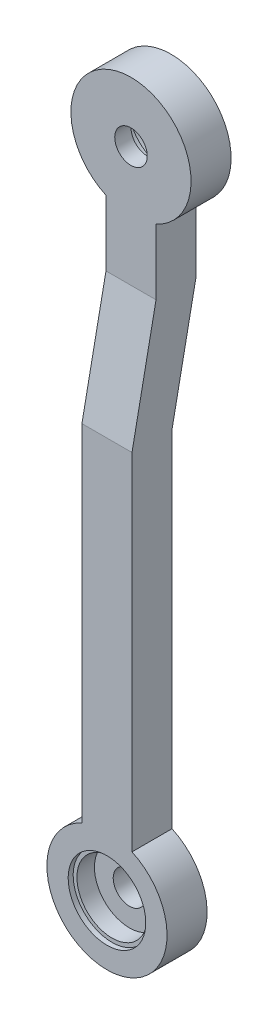
ISO-10303-21;
HEADER;
FILE_DESCRIPTION(('STEP AP214'),'2;1');
FILE_NAME('part.step','',(''),(''),'','','');
FILE_SCHEMA(('AUTOMOTIVE_DESIGN { 1 0 10303 214 1 1 1 1 }'));
ENDSEC;
DATA;
#1=APPLICATION_CONTEXT('core data for automotive mechanical design processes');
#2=APPLICATION_PROTOCOL_DEFINITION('international standard','automotive_design',2000,#1);
#3=PRODUCT_CONTEXT('',#1,'mechanical');
#4=PRODUCT('Part','Part','',(#3));
#5=PRODUCT_RELATED_PRODUCT_CATEGORY('part','',(#4));
#6=PRODUCT_DEFINITION_FORMATION('','',#4);
#7=PRODUCT_DEFINITION_CONTEXT('part definition',#1,'design');
#8=PRODUCT_DEFINITION('design','',#6,#7);
#9=PRODUCT_DEFINITION_SHAPE('','',#8);
#10=(LENGTH_UNIT() NAMED_UNIT(*) SI_UNIT(.MILLI.,.METRE.));
#11=(NAMED_UNIT(*) PLANE_ANGLE_UNIT() SI_UNIT($,.RADIAN.));
#12=(NAMED_UNIT(*) SI_UNIT($,.STERADIAN.) SOLID_ANGLE_UNIT());
#13=UNCERTAINTY_MEASURE_WITH_UNIT(LENGTH_MEASURE(1.E-05),#10,'distance_accuracy_value','');
#14=(GEOMETRIC_REPRESENTATION_CONTEXT(3) GLOBAL_UNCERTAINTY_ASSIGNED_CONTEXT((#13)) GLOBAL_UNIT_ASSIGNED_CONTEXT((#10,
#11,#12)) REPRESENTATION_CONTEXT('',''));
#15=CARTESIAN_POINT('',(0.,0.,0.));
#16=DIRECTION('',(0.,0.,1.));
#17=DIRECTION('',(1.,0.,0.));
#18=AXIS2_PLACEMENT_3D('',#15,#16,#17);
#19=CARTESIAN_POINT('',(0.,0.,6.35));
#20=DIRECTION('',(0.,0.,1.));
#21=DIRECTION('',(1.,0.,0.));
#22=AXIS2_PLACEMENT_3D('',#19,#20,#21);
#23=CYLINDRICAL_SURFACE('',#22,5.15873999999999);
#24=CARTESIAN_POINT('',(0.,0.,-6.35));
#25=DIRECTION('',(0.,0.,-1.));
#26=DIRECTION('',(0.,1.,0.));
#27=AXIS2_PLACEMENT_3D('',#24,#25,#26);
#28=CIRCLE('',#27,5.15873999999999);
#29=CARTESIAN_POINT('',(0.,5.15873999999999,-6.35));
#30=VERTEX_POINT('',#29);
#31=EDGE_CURVE('E128',#30,#30,#28,.T.);
#32=ORIENTED_EDGE('',*,*,#31,.T.);
#33=EDGE_LOOP('',(#32));
#34=FACE_BOUND('',#33,.T.);
#35=CARTESIAN_POINT('',(0.,0.,-0.79375000000001));
#36=DIRECTION('',(0.,0.,1.));
#37=DIRECTION('',(1.,0.,0.));
#38=AXIS2_PLACEMENT_3D('',#35,#36,#37);
#39=CIRCLE('',#38,5.15873999999999);
#40=CARTESIAN_POINT('',(5.15873999999999,0.,-0.79375000000001));
#41=VERTEX_POINT('',#40);
#42=EDGE_CURVE('E48',#41,#41,#39,.F.);
#43=ORIENTED_EDGE('',*,*,#42,.F.);
#44=EDGE_LOOP('',(#43));
#45=FACE_BOUND('',#44,.T.);
#46=ADVANCED_FACE('F44',(#34,#45),#23,.F.);
#47=CARTESIAN_POINT('',(0.,203.2,6.35));
#48=DIRECTION('',(0.,0.,1.));
#49=DIRECTION('',(1.,0.,0.));
#50=AXIS2_PLACEMENT_3D('',#47,#48,#49);
#51=CYLINDRICAL_SURFACE('',#50,5.15873999999999);
#52=CARTESIAN_POINT('',(0.,203.2,-1.26999999999997));
#53=DIRECTION('',(0.,0.,1.));
#54=DIRECTION('',(0.,-1.,0.));
#55=AXIS2_PLACEMENT_3D('',#52,#53,#54);
#56=CIRCLE('',#55,5.15873999999999);
#57=CARTESIAN_POINT('',(0.,198.04126,-1.26999999999997));
#58=VERTEX_POINT('',#57);
#59=EDGE_CURVE('E177',#58,#58,#56,.T.);
#60=ORIENTED_EDGE('',*,*,#59,.T.);
#61=EDGE_LOOP('',(#60));
#62=FACE_BOUND('',#61,.T.);
#63=CARTESIAN_POINT('',(0.,203.2,-6.44524999999996));
#64=DIRECTION('',(0.,0.,-1.));
#65=DIRECTION('',(-1.,0.,0.));
#66=AXIS2_PLACEMENT_3D('',#63,#64,#65);
#67=CIRCLE('',#66,5.15873999999999);
#68=CARTESIAN_POINT('',(-5.15873999999999,203.2,-6.44524999999996));
#69=VERTEX_POINT('',#68);
#70=EDGE_CURVE('E179',#69,#69,#67,.F.);
#71=ORIENTED_EDGE('',*,*,#70,.F.);
#72=EDGE_LOOP('',(#71));
#73=FACE_BOUND('',#72,.T.);
#74=ADVANCED_FACE('F241',(#62,#73),#51,.F.);
#75=CARTESIAN_POINT('',(0.,0.,6.35));
#76=DIRECTION('',(0.,0.,1.));
#77=DIRECTION('',(1.,0.,0.));
#78=AXIS2_PLACEMENT_3D('',#75,#76,#77);
#79=PLANE('',#78);
#80=CARTESIAN_POINT('',(0.,0.,6.34999999999999));
#81=DIRECTION('',(0.,0.,1.));
#82=DIRECTION('',(0.,-1.,0.));
#83=AXIS2_PLACEMENT_3D('',#80,#81,#82);
#84=CIRCLE('',#83,12.303125);
#85=CARTESIAN_POINT('',(0.,-12.303125,6.34999999999999));
#86=VERTEX_POINT('',#85);
#87=EDGE_CURVE('E199',#86,#86,#84,.T.);
#88=ORIENTED_EDGE('',*,*,#87,.F.);
#89=EDGE_LOOP('',(#88));
#90=FACE_BOUND('',#89,.T.);
#91=DIRECTION('',(0.,1.,0.));
#92=VECTOR('',#91,1.);
#93=CARTESIAN_POINT('',(7.9375,185.882419518016,6.35));
#94=LINE('',#93,#92);
#95=CARTESIAN_POINT('',(7.93749999999998,17.3175804819842,6.35));
#96=VERTEX_POINT('',#95);
#97=CARTESIAN_POINT('',(7.93749999999999,127.,6.35));
#98=VERTEX_POINT('',#97);
#99=EDGE_CURVE('E151',#96,#98,#94,.T.);
#100=ORIENTED_EDGE('',*,*,#99,.T.);
#101=DIRECTION('',(1.,0.,0.));
#102=VECTOR('',#101,1.);
#103=CARTESIAN_POINT('',(-19.05,127.,6.35));
#104=LINE('',#103,#102);
#105=CARTESIAN_POINT('',(-7.9375,127.,6.35));
#106=VERTEX_POINT('',#105);
#107=EDGE_CURVE('E208',#106,#98,#104,.T.);
#108=ORIENTED_EDGE('',*,*,#107,.F.);
#109=DIRECTION('',(0.,-1.,0.));
#110=VECTOR('',#109,1.);
#111=CARTESIAN_POINT('',(-7.9375,185.882419518016,6.35));
#112=LINE('',#111,#110);
#113=CARTESIAN_POINT('',(-7.93749999999998,17.3175804819842,6.35));
#114=VERTEX_POINT('',#113);
#115=EDGE_CURVE('E149',#106,#114,#112,.T.);
#116=ORIENTED_EDGE('',*,*,#115,.T.);
#117=CARTESIAN_POINT('',(0.,0.,6.35));
#118=DIRECTION('',(0.,0.,1.));
#119=DIRECTION('',(1.,0.,0.));
#120=AXIS2_PLACEMENT_3D('',#117,#118,#119);
#121=CIRCLE('',#120,19.05);
#122=EDGE_CURVE('E158',#114,#96,#121,.T.);
#123=ORIENTED_EDGE('',*,*,#122,.T.);
#124=EDGE_LOOP('',(#100,#108,#116,#123));
#125=FACE_BOUND('',#124,.T.);
#126=ADVANCED_FACE('F221',(#90,#125),#79,.T.);
#127=CARTESIAN_POINT('',(0.,0.,6.35));
#128=DIRECTION('',(0.,0.,-1.));
#129=DIRECTION('',(-1.,0.,0.));
#130=AXIS2_PLACEMENT_3D('',#127,#128,#129);
#131=CYLINDRICAL_SURFACE('',#130,19.05);
#132=DIRECTION('',(0.,0.,1.));
#133=VECTOR('',#132,1.);
#134=CARTESIAN_POINT('',(7.93749999999998,17.3175804819842,-6.35));
#135=LINE('',#134,#133);
#136=CARTESIAN_POINT('',(7.93749999999998,17.3175804819842,-6.35000000000002));
#137=VERTEX_POINT('',#136);
#138=EDGE_CURVE('E159',#137,#96,#135,.T.);
#139=ORIENTED_EDGE('',*,*,#138,.T.);
#140=ORIENTED_EDGE('',*,*,#122,.F.);
#141=DIRECTION('',(0.,0.,1.));
#142=VECTOR('',#141,1.);
#143=CARTESIAN_POINT('',(-7.93749999999998,17.3175804819842,-6.35));
#144=LINE('',#143,#142);
#145=CARTESIAN_POINT('',(-7.93749999999997,17.3175804819842,-6.35));
#146=VERTEX_POINT('',#145);
#147=EDGE_CURVE('E162',#146,#114,#144,.T.);
#148=ORIENTED_EDGE('',*,*,#147,.F.);
#149=CARTESIAN_POINT('',(0.,0.,-6.35));
#150=DIRECTION('',(0.,0.,-1.));
#151=DIRECTION('',(0.,1.,0.));
#152=AXIS2_PLACEMENT_3D('',#149,#150,#151);
#153=CIRCLE('',#152,19.05);
#154=EDGE_CURVE('E113',#137,#146,#153,.T.);
#155=ORIENTED_EDGE('',*,*,#154,.F.);
#156=EDGE_LOOP('',(#139,#140,#148,#155));
#157=FACE_BOUND('',#156,.T.);
#158=ADVANCED_FACE('F46',(#157),#131,.T.);
#159=CARTESIAN_POINT('',(0.,203.2,6.35));
#160=DIRECTION('',(0.,0.,-1.));
#161=DIRECTION('',(-1.,0.,0.));
#162=AXIS2_PLACEMENT_3D('',#159,#160,#161);
#163=CYLINDRICAL_SURFACE('',#162,19.05);
#164=CARTESIAN_POINT('',(0.,203.2,-1.26999999999997));
#165=DIRECTION('',(0.,0.,1.));
#166=DIRECTION('',(0.,-1.,0.));
#167=AXIS2_PLACEMENT_3D('',#164,#165,#166);
#168=CIRCLE('',#167,19.05);
#169=CARTESIAN_POINT('',(7.9375,185.882419518016,-1.26999999999997));
#170=VERTEX_POINT('',#169);
#171=CARTESIAN_POINT('',(-7.93749999999999,185.882419518016,-1.26999999999997));
#172=VERTEX_POINT('',#171);
#173=EDGE_CURVE('E141',#170,#172,#168,.T.);
#174=ORIENTED_EDGE('',*,*,#173,.F.);
#175=DIRECTION('',(0.,0.,1.));
#176=VECTOR('',#175,1.);
#177=CARTESIAN_POINT('',(7.9375,185.882419518016,-6.35));
#178=LINE('',#177,#176);
#179=CARTESIAN_POINT('',(7.9375,185.882419518016,-13.9699999999999));
#180=VERTEX_POINT('',#179);
#181=EDGE_CURVE('E155',#180,#170,#178,.T.);
#182=ORIENTED_EDGE('',*,*,#181,.F.);
#183=CARTESIAN_POINT('',(0.,203.2,-13.9699999999999));
#184=DIRECTION('',(0.,0.,-1.));
#185=DIRECTION('',(0.,1.,0.));
#186=AXIS2_PLACEMENT_3D('',#183,#184,#185);
#187=CIRCLE('',#186,19.05);
#188=CARTESIAN_POINT('',(-7.93749999999999,185.882419518016,-13.9699999999999));
#189=VERTEX_POINT('',#188);
#190=EDGE_CURVE('E135',#189,#180,#187,.T.);
#191=ORIENTED_EDGE('',*,*,#190,.F.);
#192=DIRECTION('',(0.,0.,1.));
#193=VECTOR('',#192,1.);
#194=CARTESIAN_POINT('',(-7.9375,185.882419518016,-6.35));
#195=LINE('',#194,#193);
#196=EDGE_CURVE('E154',#189,#172,#195,.T.);
#197=ORIENTED_EDGE('',*,*,#196,.T.);
#198=EDGE_LOOP('',(#174,#182,#191,#197));
#199=FACE_BOUND('',#198,.T.);
#200=ADVANCED_FACE('F227',(#199),#163,.T.);
#201=CARTESIAN_POINT('',(-7.9375,185.882419518016,-6.35));
#202=DIRECTION('',(-1.,0.,0.));
#203=DIRECTION('',(0.,-1.,0.));
#204=AXIS2_PLACEMENT_3D('',#201,#202,#203);
#205=PLANE('',#204);
#206=ORIENTED_EDGE('',*,*,#115,.F.);
#207=DIRECTION('',(0.,0.98058067569092,-0.196116135138184));
#208=VECTOR('',#207,1.);
#209=CARTESIAN_POINT('',(-7.9375,186.060018767323,-5.46200375346454));
#210=LINE('',#209,#208);
#211=CARTESIAN_POINT('',(-7.9375,165.1,-1.26999999999998));
#212=VERTEX_POINT('',#211);
#213=EDGE_CURVE('E146',#106,#212,#210,.T.);
#214=ORIENTED_EDGE('',*,*,#213,.T.);
#215=DIRECTION('',(0.,1.,0.));
#216=VECTOR('',#215,1.);
#217=CARTESIAN_POINT('',(-7.9375,185.882419518016,-1.26999999999997));
#218=LINE('',#217,#216);
#219=EDGE_CURVE('E143',#212,#172,#218,.T.);
#220=ORIENTED_EDGE('',*,*,#219,.T.);
#221=ORIENTED_EDGE('',*,*,#196,.F.);
#222=DIRECTION('',(0.,-1.,0.));
#223=VECTOR('',#222,1.);
#224=CARTESIAN_POINT('',(-7.9375,185.882419518016,-13.9699999999999));
#225=LINE('',#224,#223);
#226=CARTESIAN_POINT('',(-7.9375,165.1,-13.97));
#227=VERTEX_POINT('',#226);
#228=EDGE_CURVE('E134',#189,#227,#225,.T.);
#229=ORIENTED_EDGE('',*,*,#228,.T.);
#230=DIRECTION('',(0.,-0.98058067569092,0.196116135138183));
#231=VECTOR('',#230,1.);
#232=CARTESIAN_POINT('',(-7.9375,183.617711075015,-17.673542215003));
#233=LINE('',#232,#231);
#234=CARTESIAN_POINT('',(-7.93749999999999,127.,-6.34999999999998));
#235=VERTEX_POINT('',#234);
#236=EDGE_CURVE('E118',#227,#235,#233,.T.);
#237=ORIENTED_EDGE('',*,*,#236,.T.);
#238=DIRECTION('',(0.,-1.,0.));
#239=VECTOR('',#238,1.);
#240=CARTESIAN_POINT('',(-7.9375,185.882419518016,-6.35));
#241=LINE('',#240,#239);
#242=EDGE_CURVE('E111',#235,#146,#241,.T.);
#243=ORIENTED_EDGE('',*,*,#242,.T.);
#244=ORIENTED_EDGE('',*,*,#147,.T.);
#245=EDGE_LOOP('',(#206,#214,#220,#221,#229,#237,#243,#244));
#246=FACE_BOUND('',#245,.T.);
#247=ADVANCED_FACE('F132',(#246),#205,.T.);
#248=CARTESIAN_POINT('',(7.9375,185.882419518016,-6.35));
#249=DIRECTION('',(1.,0.,0.));
#250=DIRECTION('',(0.,1.,0.));
#251=AXIS2_PLACEMENT_3D('',#248,#249,#250);
#252=PLANE('',#251);
#253=DIRECTION('',(0.,-1.,0.));
#254=VECTOR('',#253,1.);
#255=CARTESIAN_POINT('',(7.9375,185.882419518016,-1.26999999999997));
#256=LINE('',#255,#254);
#257=CARTESIAN_POINT('',(7.93749999999999,165.1,-1.26999999999998));
#258=VERTEX_POINT('',#257);
#259=EDGE_CURVE('E53',#170,#258,#256,.T.);
#260=ORIENTED_EDGE('',*,*,#259,.T.);
#261=DIRECTION('',(0.,-0.98058067569092,0.196116135138184));
#262=VECTOR('',#261,1.);
#263=CARTESIAN_POINT('',(7.9375,186.060018767323,-5.46200375346454));
#264=LINE('',#263,#262);
#265=EDGE_CURVE('E13',#258,#98,#264,.T.);
#266=ORIENTED_EDGE('',*,*,#265,.T.);
#267=ORIENTED_EDGE('',*,*,#99,.F.);
#268=ORIENTED_EDGE('',*,*,#138,.F.);
#269=DIRECTION('',(0.,1.,0.));
#270=VECTOR('',#269,1.);
#271=CARTESIAN_POINT('',(7.9375,185.882419518016,-6.35));
#272=LINE('',#271,#270);
#273=CARTESIAN_POINT('',(7.93749999999999,127.,-6.35000000000001));
#274=VERTEX_POINT('',#273);
#275=EDGE_CURVE('E167',#137,#274,#272,.T.);
#276=ORIENTED_EDGE('',*,*,#275,.T.);
#277=DIRECTION('',(0.,0.98058067569092,-0.196116135138183));
#278=VECTOR('',#277,1.);
#279=CARTESIAN_POINT('',(7.9375,183.617711075015,-17.673542215003));
#280=LINE('',#279,#278);
#281=CARTESIAN_POINT('',(7.93749999999999,165.1,-13.97));
#282=VERTEX_POINT('',#281);
#283=EDGE_CURVE('E125',#274,#282,#280,.T.);
#284=ORIENTED_EDGE('',*,*,#283,.T.);
#285=DIRECTION('',(0.,1.,0.));
#286=VECTOR('',#285,1.);
#287=CARTESIAN_POINT('',(7.9375,185.882419518016,-13.9699999999999));
#288=LINE('',#287,#286);
#289=EDGE_CURVE('E170',#282,#180,#288,.T.);
#290=ORIENTED_EDGE('',*,*,#289,.T.);
#291=ORIENTED_EDGE('',*,*,#181,.T.);
#292=EDGE_LOOP('',(#260,#266,#267,#268,#276,#284,#290,#291));
#293=FACE_BOUND('',#292,.T.);
#294=ADVANCED_FACE('F213',(#293),#252,.T.);
#295=CARTESIAN_POINT('',(-19.05,127.,-6.34999999999998));
#296=DIRECTION('',(0.,0.,-1.));
#297=DIRECTION('',(0.,1.,0.));
#298=AXIS2_PLACEMENT_3D('',#295,#296,#297);
#299=PLANE('',#298);
#300=ORIENTED_EDGE('',*,*,#31,.F.);
#301=EDGE_LOOP('',(#300));
#302=FACE_BOUND('',#301,.T.);
#303=DIRECTION('',(1.,0.,0.));
#304=VECTOR('',#303,1.);
#305=CARTESIAN_POINT('',(-19.05,127.,-6.34999999999998));
#306=LINE('',#305,#304);
#307=EDGE_CURVE('E69',#235,#274,#306,.T.);
#308=ORIENTED_EDGE('',*,*,#307,.T.);
#309=ORIENTED_EDGE('',*,*,#275,.F.);
#310=ORIENTED_EDGE('',*,*,#154,.T.);
#311=ORIENTED_EDGE('',*,*,#242,.F.);
#312=EDGE_LOOP('',(#308,#309,#310,#311));
#313=FACE_BOUND('',#312,.T.);
#314=ADVANCED_FACE('F112',(#302,#313),#299,.T.);
#315=CARTESIAN_POINT('',(-19.05,165.1,-13.97));
#316=DIRECTION('',(0.,-0.196116135138183,-0.98058067569092));
#317=DIRECTION('',(0.,0.98058067569092,-0.196116135138183));
#318=AXIS2_PLACEMENT_3D('',#315,#316,#317);
#319=PLANE('',#318);
#320=DIRECTION('',(1.,0.,0.));
#321=VECTOR('',#320,1.);
#322=CARTESIAN_POINT('',(-19.05,165.1,-13.97));
#323=LINE('',#322,#321);
#324=EDGE_CURVE('E127',#227,#282,#323,.T.);
#325=ORIENTED_EDGE('',*,*,#324,.T.);
#326=ORIENTED_EDGE('',*,*,#283,.F.);
#327=ORIENTED_EDGE('',*,*,#307,.F.);
#328=ORIENTED_EDGE('',*,*,#236,.F.);
#329=EDGE_LOOP('',(#325,#326,#327,#328));
#330=FACE_BOUND('',#329,.T.);
#331=ADVANCED_FACE('F122',(#330),#319,.T.);
#332=CARTESIAN_POINT('',(-19.05,222.25,-13.9699999999999));
#333=DIRECTION('',(0.,0.,-1.));
#334=DIRECTION('',(0.,1.,0.));
#335=AXIS2_PLACEMENT_3D('',#332,#333,#334);
#336=PLANE('',#335);
#337=CARTESIAN_POINT('',(0.,203.2,-13.97));
#338=DIRECTION('',(0.,0.,-1.));
#339=DIRECTION('',(0.,1.,0.));
#340=AXIS2_PLACEMENT_3D('',#337,#338,#339);
#341=CIRCLE('',#340,12.684125);
#342=CARTESIAN_POINT('',(0.,215.884125,-13.97));
#343=VERTEX_POINT('',#342);
#344=EDGE_CURVE('E207',#343,#343,#341,.T.);
#345=ORIENTED_EDGE('',*,*,#344,.F.);
#346=EDGE_LOOP('',(#345));
#347=FACE_BOUND('',#346,.T.);
#348=ORIENTED_EDGE('',*,*,#190,.T.);
#349=ORIENTED_EDGE('',*,*,#289,.F.);
#350=ORIENTED_EDGE('',*,*,#324,.F.);
#351=ORIENTED_EDGE('',*,*,#228,.F.);
#352=EDGE_LOOP('',(#348,#349,#350,#351));
#353=FACE_BOUND('',#352,.T.);
#354=ADVANCED_FACE('F228',(#347,#353),#336,.T.);
#355=CARTESIAN_POINT('',(-19.05,165.1,-1.26999999999998));
#356=DIRECTION('',(0.,0.,1.));
#357=DIRECTION('',(0.,-1.,0.));
#358=AXIS2_PLACEMENT_3D('',#355,#356,#357);
#359=PLANE('',#358);
#360=ORIENTED_EDGE('',*,*,#59,.F.);
#361=EDGE_LOOP('',(#360));
#362=FACE_BOUND('',#361,.T.);
#363=DIRECTION('',(1.,0.,0.));
#364=VECTOR('',#363,1.);
#365=CARTESIAN_POINT('',(-19.05,165.1,-1.26999999999998));
#366=LINE('',#365,#364);
#367=EDGE_CURVE('E61',#212,#258,#366,.T.);
#368=ORIENTED_EDGE('',*,*,#367,.T.);
#369=ORIENTED_EDGE('',*,*,#259,.F.);
#370=ORIENTED_EDGE('',*,*,#173,.T.);
#371=ORIENTED_EDGE('',*,*,#219,.F.);
#372=EDGE_LOOP('',(#368,#369,#370,#371));
#373=FACE_BOUND('',#372,.T.);
#374=ADVANCED_FACE('F224',(#362,#373),#359,.T.);
#375=CARTESIAN_POINT('',(-19.05,127.,6.35));
#376=DIRECTION('',(0.,0.196116135138184,0.98058067569092));
#377=DIRECTION('',(0.,-0.98058067569092,0.196116135138184));
#378=AXIS2_PLACEMENT_3D('',#375,#376,#377);
#379=PLANE('',#378);
#380=ORIENTED_EDGE('',*,*,#107,.T.);
#381=ORIENTED_EDGE('',*,*,#265,.F.);
#382=ORIENTED_EDGE('',*,*,#367,.F.);
#383=ORIENTED_EDGE('',*,*,#213,.F.);
#384=EDGE_LOOP('',(#380,#381,#382,#383));
#385=FACE_BOUND('',#384,.T.);
#386=ADVANCED_FACE('F223',(#385),#379,.T.);
#387=CARTESIAN_POINT('',(0.,203.2,-6.44524999999996));
#388=DIRECTION('',(0.,0.,-1.));
#389=DIRECTION('',(0.,1.,0.));
#390=AXIS2_PLACEMENT_3D('',#387,#388,#389);
#391=PLANE('',#390);
#392=CARTESIAN_POINT('',(0.,203.2,-6.44524999999996));
#393=DIRECTION('',(0.,0.,-1.));
#394=DIRECTION('',(0.,1.,0.));
#395=AXIS2_PLACEMENT_3D('',#392,#393,#394);
#396=CIRCLE('',#395,11.4935);
#397=CARTESIAN_POINT('',(0.,214.6935,-6.44524999999996));
#398=VERTEX_POINT('',#397);
#399=EDGE_CURVE('E186',#398,#398,#396,.T.);
#400=ORIENTED_EDGE('',*,*,#399,.T.);
#401=EDGE_LOOP('',(#400));
#402=FACE_BOUND('',#401,.T.);
#403=ORIENTED_EDGE('',*,*,#70,.T.);
#404=EDGE_LOOP('',(#403));
#405=FACE_BOUND('',#404,.T.);
#406=ADVANCED_FACE('F254',(#402,#405),#391,.T.);
#407=CARTESIAN_POINT('',(0.,203.2,-13.97));
#408=DIRECTION('',(0.,0.,1.));
#409=DIRECTION('',(0.,-1.,0.));
#410=AXIS2_PLACEMENT_3D('',#407,#408,#409);
#411=CYLINDRICAL_SURFACE('',#410,11.4935);
#412=ORIENTED_EDGE('',*,*,#399,.F.);
#413=EDGE_LOOP('',(#412));
#414=FACE_BOUND('',#413,.T.);
#415=CARTESIAN_POINT('',(0.,203.2,-12.0014999999999));
#416=DIRECTION('',(0.,0.,-1.));
#417=DIRECTION('',(0.,1.,0.));
#418=AXIS2_PLACEMENT_3D('',#415,#416,#417);
#419=CIRCLE('',#418,11.4935);
#420=CARTESIAN_POINT('',(0.,214.6935,-12.0014999999999));
#421=VERTEX_POINT('',#420);
#422=EDGE_CURVE('E181',#421,#421,#419,.T.);
#423=ORIENTED_EDGE('',*,*,#422,.T.);
#424=EDGE_LOOP('',(#423));
#425=FACE_BOUND('',#424,.T.);
#426=ADVANCED_FACE('F258',(#414,#425),#411,.F.);
#427=CARTESIAN_POINT('',(0.,203.2,-12.3825));
#428=DIRECTION('',(0.,0.,-1.));
#429=DIRECTION('',(0.,1.,0.));
#430=AXIS2_PLACEMENT_3D('',#427,#428,#429);
#431=CYLINDRICAL_SURFACE('',#430,12.684125);
#432=CARTESIAN_POINT('',(0.,203.2,-12.0014999999999));
#433=DIRECTION('',(0.,0.,-1.));
#434=DIRECTION('',(0.,1.,0.));
#435=AXIS2_PLACEMENT_3D('',#432,#433,#434);
#436=CIRCLE('',#435,12.684125);
#437=CARTESIAN_POINT('',(0.,215.884125,-12.0014999999999));
#438=VERTEX_POINT('',#437);
#439=EDGE_CURVE('E191',#438,#438,#436,.T.);
#440=ORIENTED_EDGE('',*,*,#439,.F.);
#441=EDGE_LOOP('',(#440));
#442=FACE_BOUND('',#441,.T.);
#443=ORIENTED_EDGE('',*,*,#344,.T.);
#444=EDGE_LOOP('',(#443));
#445=FACE_BOUND('',#444,.T.);
#446=ADVANCED_FACE('F263',(#442,#445),#431,.F.);
#447=CARTESIAN_POINT('',(0.,203.2,-12.0014999999999));
#448=DIRECTION('',(0.,0.,-1.));
#449=DIRECTION('',(0.,1.,0.));
#450=AXIS2_PLACEMENT_3D('',#447,#448,#449);
#451=PLANE('',#450);
#452=ORIENTED_EDGE('',*,*,#422,.F.);
#453=EDGE_LOOP('',(#452));
#454=FACE_BOUND('',#453,.T.);
#455=ORIENTED_EDGE('',*,*,#439,.T.);
#456=EDGE_LOOP('',(#455));
#457=FACE_BOUND('',#456,.T.);
#458=ADVANCED_FACE('F268',(#454,#457),#451,.T.);
#459=CARTESIAN_POINT('',(0.,0.,-0.79375000000001));
#460=DIRECTION('',(0.,0.,1.));
#461=DIRECTION('',(0.,-1.,0.));
#462=AXIS2_PLACEMENT_3D('',#459,#460,#461);
#463=PLANE('',#462);
#464=CARTESIAN_POINT('',(0.,0.,-0.79375000000001));
#465=DIRECTION('',(0.,0.,1.));
#466=DIRECTION('',(0.,-1.,0.));
#467=AXIS2_PLACEMENT_3D('',#464,#465,#466);
#468=CIRCLE('',#467,11.1125);
#469=CARTESIAN_POINT('',(0.,-11.1125,-0.79375000000001));
#470=VERTEX_POINT('',#469);
#471=EDGE_CURVE('E198',#470,#470,#468,.T.);
#472=ORIENTED_EDGE('',*,*,#471,.T.);
#473=EDGE_LOOP('',(#472));
#474=FACE_BOUND('',#473,.T.);
#475=ORIENTED_EDGE('',*,*,#42,.T.);
#476=EDGE_LOOP('',(#475));
#477=FACE_BOUND('',#476,.T.);
#478=ADVANCED_FACE('F281',(#474,#477),#463,.T.);
#479=CARTESIAN_POINT('',(0.,0.,6.34999999999999));
#480=DIRECTION('',(0.,0.,-1.));
#481=DIRECTION('',(0.,1.,0.));
#482=AXIS2_PLACEMENT_3D('',#479,#480,#481);
#483=CYLINDRICAL_SURFACE('',#482,11.1125);
#484=ORIENTED_EDGE('',*,*,#471,.F.);
#485=EDGE_LOOP('',(#484));
#486=FACE_BOUND('',#485,.T.);
#487=CARTESIAN_POINT('',(0.,0.,4.7625));
#488=DIRECTION('',(0.,0.,1.));
#489=DIRECTION('',(0.,-1.,0.));
#490=AXIS2_PLACEMENT_3D('',#487,#488,#489);
#491=CIRCLE('',#490,11.1125);
#492=CARTESIAN_POINT('',(0.,-11.1125,4.7625));
#493=VERTEX_POINT('',#492);
#494=EDGE_CURVE('E204',#493,#493,#491,.T.);
#495=ORIENTED_EDGE('',*,*,#494,.T.);
#496=EDGE_LOOP('',(#495));
#497=FACE_BOUND('',#496,.T.);
#498=ADVANCED_FACE('F279',(#486,#497),#483,.F.);
#499=CARTESIAN_POINT('',(0.,0.,4.7625));
#500=DIRECTION('',(0.,0.,1.));
#501=DIRECTION('',(0.,-1.,0.));
#502=AXIS2_PLACEMENT_3D('',#499,#500,#501);
#503=CYLINDRICAL_SURFACE('',#502,12.303125);
#504=CARTESIAN_POINT('',(0.,0.,4.7625));
#505=DIRECTION('',(0.,0.,1.));
#506=DIRECTION('',(0.,-1.,0.));
#507=AXIS2_PLACEMENT_3D('',#504,#505,#506);
#508=CIRCLE('',#507,12.303125);
#509=CARTESIAN_POINT('',(0.,-12.303125,4.7625));
#510=VERTEX_POINT('',#509);
#511=EDGE_CURVE('E195',#510,#510,#508,.T.);
#512=ORIENTED_EDGE('',*,*,#511,.F.);
#513=EDGE_LOOP('',(#512));
#514=FACE_BOUND('',#513,.T.);
#515=ORIENTED_EDGE('',*,*,#87,.T.);
#516=EDGE_LOOP('',(#515));
#517=FACE_BOUND('',#516,.T.);
#518=ADVANCED_FACE('F275',(#514,#517),#503,.F.);
#519=CARTESIAN_POINT('',(0.,0.,4.7625));
#520=DIRECTION('',(0.,0.,1.));
#521=DIRECTION('',(0.,-1.,0.));
#522=AXIS2_PLACEMENT_3D('',#519,#520,#521);
#523=PLANE('',#522);
#524=ORIENTED_EDGE('',*,*,#494,.F.);
#525=EDGE_LOOP('',(#524));
#526=FACE_BOUND('',#525,.T.);
#527=ORIENTED_EDGE('',*,*,#511,.T.);
#528=EDGE_LOOP('',(#527));
#529=FACE_BOUND('',#528,.T.);
#530=ADVANCED_FACE('F272',(#526,#529),#523,.T.);
#531=CLOSED_SHELL('',(#46,#74,#126,#158,#200,#247,#294,#314,#331,#354,#374,#386,#406,#426,#446,
#458,#478,#498,#518,#530));
#532=MANIFOLD_SOLID_BREP('B2',#531);
#533=ADVANCED_BREP_SHAPE_REPRESENTATION('',(#18,#532),#14);
#534=SHAPE_DEFINITION_REPRESENTATION(#9,#533);
ENDSEC;
END-ISO-10303-21;
